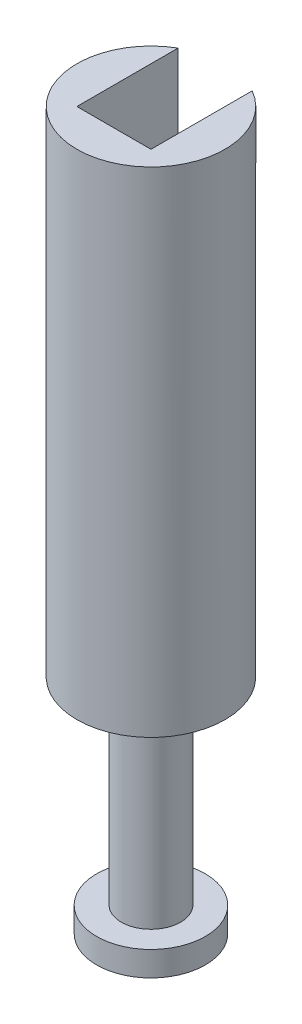
ISO-10303-21;
HEADER;
FILE_DESCRIPTION(('STEP AP214'),'2;1');
FILE_NAME('part.step','',(''),(''),'','','');
FILE_SCHEMA(('AUTOMOTIVE_DESIGN { 1 0 10303 214 1 1 1 1 }'));
ENDSEC;
DATA;
#1=APPLICATION_CONTEXT('core data for automotive mechanical design processes');
#2=APPLICATION_PROTOCOL_DEFINITION('international standard','automotive_design',2000,#1);
#3=PRODUCT_CONTEXT('',#1,'mechanical');
#4=PRODUCT('Part','Part','',(#3));
#5=PRODUCT_RELATED_PRODUCT_CATEGORY('part','',(#4));
#6=PRODUCT_DEFINITION_FORMATION('','',#4);
#7=PRODUCT_DEFINITION_CONTEXT('part definition',#1,'design');
#8=PRODUCT_DEFINITION('design','',#6,#7);
#9=PRODUCT_DEFINITION_SHAPE('','',#8);
#10=(LENGTH_UNIT() NAMED_UNIT(*) SI_UNIT(.MILLI.,.METRE.));
#11=(NAMED_UNIT(*) PLANE_ANGLE_UNIT() SI_UNIT($,.RADIAN.));
#12=(NAMED_UNIT(*) SI_UNIT($,.STERADIAN.) SOLID_ANGLE_UNIT());
#13=UNCERTAINTY_MEASURE_WITH_UNIT(LENGTH_MEASURE(1.E-05),#10,'distance_accuracy_value','');
#14=(GEOMETRIC_REPRESENTATION_CONTEXT(3) GLOBAL_UNCERTAINTY_ASSIGNED_CONTEXT((#13)) GLOBAL_UNIT_ASSIGNED_CONTEXT((#10,
#11,#12)) REPRESENTATION_CONTEXT('',''));
#15=CARTESIAN_POINT('',(0.,0.,0.));
#16=DIRECTION('',(0.,0.,1.));
#17=DIRECTION('',(1.,0.,0.));
#18=AXIS2_PLACEMENT_3D('',#15,#16,#17);
#19=CARTESIAN_POINT('',(0.,100.,0.));
#20=DIRECTION('',(0.,-1.,0.));
#21=DIRECTION('',(0.,0.,-1.));
#22=AXIS2_PLACEMENT_3D('',#19,#20,#21);
#23=CYLINDRICAL_SURFACE('',#22,15.);
#24=CARTESIAN_POINT('',(0.,0.,0.));
#25=DIRECTION('',(0.,1.,0.));
#26=DIRECTION('',(0.,0.,1.));
#27=AXIS2_PLACEMENT_3D('',#24,#25,#26);
#28=CIRCLE('',#27,15.);
#29=CARTESIAN_POINT('',(0.,0.,15.));
#30=VERTEX_POINT('',#29);
#31=EDGE_CURVE('E42',#30,#30,#28,.T.);
#32=ORIENTED_EDGE('',*,*,#31,.T.);
#33=EDGE_LOOP('',(#32));
#34=FACE_BOUND('',#33,.T.);
#35=DIRECTION('',(0.,1.,0.));
#36=VECTOR('',#35,1.);
#37=CARTESIAN_POINT('',(-7.5,25.,-12.9903810567666));
#38=LINE('',#37,#36);
#39=CARTESIAN_POINT('',(-7.5,25.,-12.9903810567666));
#40=VERTEX_POINT('',#39);
#41=CARTESIAN_POINT('',(-7.5,100.,-12.9903810567666));
#42=VERTEX_POINT('',#41);
#43=EDGE_CURVE('E96',#40,#42,#38,.T.);
#44=ORIENTED_EDGE('',*,*,#43,.F.);
#45=CARTESIAN_POINT('',(0.,25.,0.));
#46=DIRECTION('',(0.,1.,0.));
#47=DIRECTION('',(0.,0.,1.));
#48=AXIS2_PLACEMENT_3D('',#45,#46,#47);
#49=CIRCLE('',#48,15.);
#50=CARTESIAN_POINT('',(7.5,25.,-12.9903810567666));
#51=VERTEX_POINT('',#50);
#52=EDGE_CURVE('E101',#51,#40,#49,.T.);
#53=ORIENTED_EDGE('',*,*,#52,.F.);
#54=DIRECTION('',(0.,1.,0.));
#55=VECTOR('',#54,1.);
#56=CARTESIAN_POINT('',(7.5,25.,-12.9903810567666));
#57=LINE('',#56,#55);
#58=CARTESIAN_POINT('',(7.5,100.,-12.9903810567666));
#59=VERTEX_POINT('',#58);
#60=EDGE_CURVE('E84',#51,#59,#57,.T.);
#61=ORIENTED_EDGE('',*,*,#60,.T.);
#62=CARTESIAN_POINT('',(0.,100.,0.));
#63=DIRECTION('',(0.,1.,0.));
#64=DIRECTION('',(0.,0.,1.));
#65=AXIS2_PLACEMENT_3D('',#62,#63,#64);
#66=CIRCLE('',#65,15.);
#67=EDGE_CURVE('E48',#42,#59,#66,.T.);
#68=ORIENTED_EDGE('',*,*,#67,.F.);
#69=EDGE_LOOP('',(#44,#53,#61,#68));
#70=FACE_BOUND('',#69,.T.);
#71=ADVANCED_FACE('F39',(#34,#70),#23,.T.);
#72=CARTESIAN_POINT('',(0.,100.,0.));
#73=DIRECTION('',(0.,1.,0.));
#74=DIRECTION('',(0.,0.,1.));
#75=AXIS2_PLACEMENT_3D('',#72,#73,#74);
#76=PLANE('',#75);
#77=DIRECTION('',(1.,0.,0.));
#78=VECTOR('',#77,1.);
#79=CARTESIAN_POINT('',(0.,100.,7.5));
#80=LINE('',#79,#78);
#81=CARTESIAN_POINT('',(-7.5,100.,7.5));
#82=VERTEX_POINT('',#81);
#83=CARTESIAN_POINT('',(7.5,100.,7.5));
#84=VERTEX_POINT('',#83);
#85=EDGE_CURVE('E56',#82,#84,#80,.T.);
#86=ORIENTED_EDGE('',*,*,#85,.F.);
#87=DIRECTION('',(0.,0.,-1.));
#88=VECTOR('',#87,1.);
#89=CARTESIAN_POINT('',(-7.5,100.,0.));
#90=LINE('',#89,#88);
#91=EDGE_CURVE('E118',#82,#42,#90,.T.);
#92=ORIENTED_EDGE('',*,*,#91,.T.);
#93=ORIENTED_EDGE('',*,*,#67,.T.);
#94=DIRECTION('',(0.,0.,-1.));
#95=VECTOR('',#94,1.);
#96=CARTESIAN_POINT('',(7.5,100.,0.));
#97=LINE('',#96,#95);
#98=EDGE_CURVE('E90',#84,#59,#97,.T.);
#99=ORIENTED_EDGE('',*,*,#98,.F.);
#100=EDGE_LOOP('',(#86,#92,#93,#99));
#101=FACE_BOUND('',#100,.T.);
#102=ADVANCED_FACE('F137',(#101),#76,.T.);
#103=CARTESIAN_POINT('',(0.,0.,0.));
#104=DIRECTION('',(0.,1.,0.));
#105=DIRECTION('',(0.,0.,1.));
#106=AXIS2_PLACEMENT_3D('',#103,#104,#105);
#107=PLANE('',#106);
#108=CARTESIAN_POINT('',(0.,0.,0.));
#109=DIRECTION('',(0.,-1.,0.));
#110=DIRECTION('',(0.,0.,-1.));
#111=AXIS2_PLACEMENT_3D('',#108,#109,#110);
#112=CIRCLE('',#111,6.);
#113=CARTESIAN_POINT('',(0.,0.,-6.));
#114=VERTEX_POINT('',#113);
#115=EDGE_CURVE('E11',#114,#114,#112,.T.);
#116=ORIENTED_EDGE('',*,*,#115,.F.);
#117=EDGE_LOOP('',(#116));
#118=FACE_BOUND('',#117,.T.);
#119=ORIENTED_EDGE('',*,*,#31,.F.);
#120=EDGE_LOOP('',(#119));
#121=FACE_BOUND('',#120,.T.);
#122=ADVANCED_FACE('F134',(#118,#121),#107,.F.);
#123=CARTESIAN_POINT('',(0.,25.,7.5));
#124=DIRECTION('',(0.,0.,1.));
#125=DIRECTION('',(1.,0.,0.));
#126=AXIS2_PLACEMENT_3D('',#123,#124,#125);
#127=PLANE('',#126);
#128=ORIENTED_EDGE('',*,*,#85,.T.);
#129=DIRECTION('',(0.,1.,0.));
#130=VECTOR('',#129,1.);
#131=CARTESIAN_POINT('',(7.5,25.,7.5));
#132=LINE('',#131,#130);
#133=CARTESIAN_POINT('',(7.5,25.,7.5));
#134=VERTEX_POINT('',#133);
#135=EDGE_CURVE('E79',#134,#84,#132,.T.);
#136=ORIENTED_EDGE('',*,*,#135,.F.);
#137=DIRECTION('',(1.,0.,0.));
#138=VECTOR('',#137,1.);
#139=CARTESIAN_POINT('',(0.,25.,7.5));
#140=LINE('',#139,#138);
#141=CARTESIAN_POINT('',(-7.5,25.,7.5));
#142=VERTEX_POINT('',#141);
#143=EDGE_CURVE('E103',#142,#134,#140,.T.);
#144=ORIENTED_EDGE('',*,*,#143,.F.);
#145=DIRECTION('',(0.,1.,0.));
#146=VECTOR('',#145,1.);
#147=CARTESIAN_POINT('',(-7.5,25.,7.5));
#148=LINE('',#147,#146);
#149=EDGE_CURVE('E64',#142,#82,#148,.T.);
#150=ORIENTED_EDGE('',*,*,#149,.T.);
#151=EDGE_LOOP('',(#128,#136,#144,#150));
#152=FACE_BOUND('',#151,.T.);
#153=ADVANCED_FACE('F136',(#152),#127,.F.);
#154=CARTESIAN_POINT('',(-7.5,25.,0.));
#155=DIRECTION('',(1.,0.,0.));
#156=DIRECTION('',(0.,0.,-1.));
#157=AXIS2_PLACEMENT_3D('',#154,#155,#156);
#158=PLANE('',#157);
#159=ORIENTED_EDGE('',*,*,#91,.F.);
#160=ORIENTED_EDGE('',*,*,#149,.F.);
#161=DIRECTION('',(0.,0.,-1.));
#162=VECTOR('',#161,1.);
#163=CARTESIAN_POINT('',(-7.5,25.,0.));
#164=LINE('',#163,#162);
#165=EDGE_CURVE('E107',#142,#40,#164,.T.);
#166=ORIENTED_EDGE('',*,*,#165,.T.);
#167=ORIENTED_EDGE('',*,*,#43,.T.);
#168=EDGE_LOOP('',(#159,#160,#166,#167));
#169=FACE_BOUND('',#168,.T.);
#170=ADVANCED_FACE('F143',(#169),#158,.T.);
#171=CARTESIAN_POINT('',(7.5,25.,0.));
#172=DIRECTION('',(1.,0.,0.));
#173=DIRECTION('',(0.,0.,-1.));
#174=AXIS2_PLACEMENT_3D('',#171,#172,#173);
#175=PLANE('',#174);
#176=ORIENTED_EDGE('',*,*,#98,.T.);
#177=ORIENTED_EDGE('',*,*,#60,.F.);
#178=DIRECTION('',(0.,0.,-1.));
#179=VECTOR('',#178,1.);
#180=CARTESIAN_POINT('',(7.5,25.,0.));
#181=LINE('',#180,#179);
#182=EDGE_CURVE('E87',#134,#51,#181,.T.);
#183=ORIENTED_EDGE('',*,*,#182,.F.);
#184=ORIENTED_EDGE('',*,*,#135,.T.);
#185=EDGE_LOOP('',(#176,#177,#183,#184));
#186=FACE_BOUND('',#185,.T.);
#187=ADVANCED_FACE('F86',(#186),#175,.F.);
#188=CARTESIAN_POINT('',(0.,25.,0.));
#189=DIRECTION('',(0.,1.,0.));
#190=DIRECTION('',(0.,0.,1.));
#191=AXIS2_PLACEMENT_3D('',#188,#189,#190);
#192=PLANE('',#191);
#193=ORIENTED_EDGE('',*,*,#143,.T.);
#194=ORIENTED_EDGE('',*,*,#182,.T.);
#195=ORIENTED_EDGE('',*,*,#52,.T.);
#196=ORIENTED_EDGE('',*,*,#165,.F.);
#197=EDGE_LOOP('',(#193,#194,#195,#196));
#198=FACE_BOUND('',#197,.T.);
#199=ADVANCED_FACE('F100',(#198),#192,.T.);
#200=CARTESIAN_POINT('',(0.,-40.,0.));
#201=DIRECTION('',(0.,1.,0.));
#202=DIRECTION('',(0.,0.,1.));
#203=AXIS2_PLACEMENT_3D('',#200,#201,#202);
#204=CYLINDRICAL_SURFACE('',#203,6.);
#205=CARTESIAN_POINT('',(0.,-40.,0.));
#206=DIRECTION('',(0.,-1.,0.));
#207=DIRECTION('',(0.,0.,-1.));
#208=AXIS2_PLACEMENT_3D('',#205,#206,#207);
#209=CIRCLE('',#208,6.);
#210=CARTESIAN_POINT('',(0.,-40.,-6.));
#211=VERTEX_POINT('',#210);
#212=EDGE_CURVE('E115',#211,#211,#209,.T.);
#213=ORIENTED_EDGE('',*,*,#212,.F.);
#214=EDGE_LOOP('',(#213));
#215=FACE_BOUND('',#214,.T.);
#216=ORIENTED_EDGE('',*,*,#115,.T.);
#217=EDGE_LOOP('',(#216));
#218=FACE_BOUND('',#217,.T.);
#219=ADVANCED_FACE('F188',(#215,#218),#204,.T.);
#220=CARTESIAN_POINT('',(0.,-45.,0.));
#221=DIRECTION('',(0.,1.,0.));
#222=DIRECTION('',(0.,0.,1.));
#223=AXIS2_PLACEMENT_3D('',#220,#221,#222);
#224=CYLINDRICAL_SURFACE('',#223,11.);
#225=CARTESIAN_POINT('',(0.,-45.,0.));
#226=DIRECTION('',(0.,-1.,0.));
#227=DIRECTION('',(0.,0.,-1.));
#228=AXIS2_PLACEMENT_3D('',#225,#226,#227);
#229=CIRCLE('',#228,11.);
#230=CARTESIAN_POINT('',(0.,-45.,-11.));
#231=VERTEX_POINT('',#230);
#232=EDGE_CURVE('E243',#231,#231,#229,.T.);
#233=ORIENTED_EDGE('',*,*,#232,.F.);
#234=EDGE_LOOP('',(#233));
#235=FACE_BOUND('',#234,.T.);
#236=CARTESIAN_POINT('',(0.,-40.,0.));
#237=DIRECTION('',(0.,-1.,0.));
#238=DIRECTION('',(0.,0.,-1.));
#239=AXIS2_PLACEMENT_3D('',#236,#237,#238);
#240=CIRCLE('',#239,11.);
#241=CARTESIAN_POINT('',(0.,-40.,-11.));
#242=VERTEX_POINT('',#241);
#243=EDGE_CURVE('E240',#242,#242,#240,.T.);
#244=ORIENTED_EDGE('',*,*,#243,.T.);
#245=EDGE_LOOP('',(#244));
#246=FACE_BOUND('',#245,.T.);
#247=ADVANCED_FACE('F201',(#235,#246),#224,.T.);
#248=CARTESIAN_POINT('',(0.,-45.,0.));
#249=DIRECTION('',(0.,-1.,0.));
#250=DIRECTION('',(0.,0.,-1.));
#251=AXIS2_PLACEMENT_3D('',#248,#249,#250);
#252=PLANE('',#251);
#253=ORIENTED_EDGE('',*,*,#232,.T.);
#254=EDGE_LOOP('',(#253));
#255=FACE_BOUND('',#254,.T.);
#256=ADVANCED_FACE('F211',(#255),#252,.T.);
#257=CARTESIAN_POINT('',(0.,-40.,0.));
#258=DIRECTION('',(0.,-1.,0.));
#259=DIRECTION('',(0.,0.,-1.));
#260=AXIS2_PLACEMENT_3D('',#257,#258,#259);
#261=PLANE('',#260);
#262=ORIENTED_EDGE('',*,*,#212,.T.);
#263=EDGE_LOOP('',(#262));
#264=FACE_BOUND('',#263,.T.);
#265=ORIENTED_EDGE('',*,*,#243,.F.);
#266=EDGE_LOOP('',(#265));
#267=FACE_BOUND('',#266,.T.);
#268=ADVANCED_FACE('F221',(#264,#267),#261,.F.);
#269=CLOSED_SHELL('',(#71,#102,#122,#153,#170,#187,#199,#219,#247,#256,#268));
#270=MANIFOLD_SOLID_BREP('B2',#269);
#271=ADVANCED_BREP_SHAPE_REPRESENTATION('',(#18,#270),#14);
#272=SHAPE_DEFINITION_REPRESENTATION(#9,#271);
ENDSEC;
END-ISO-10303-21;
